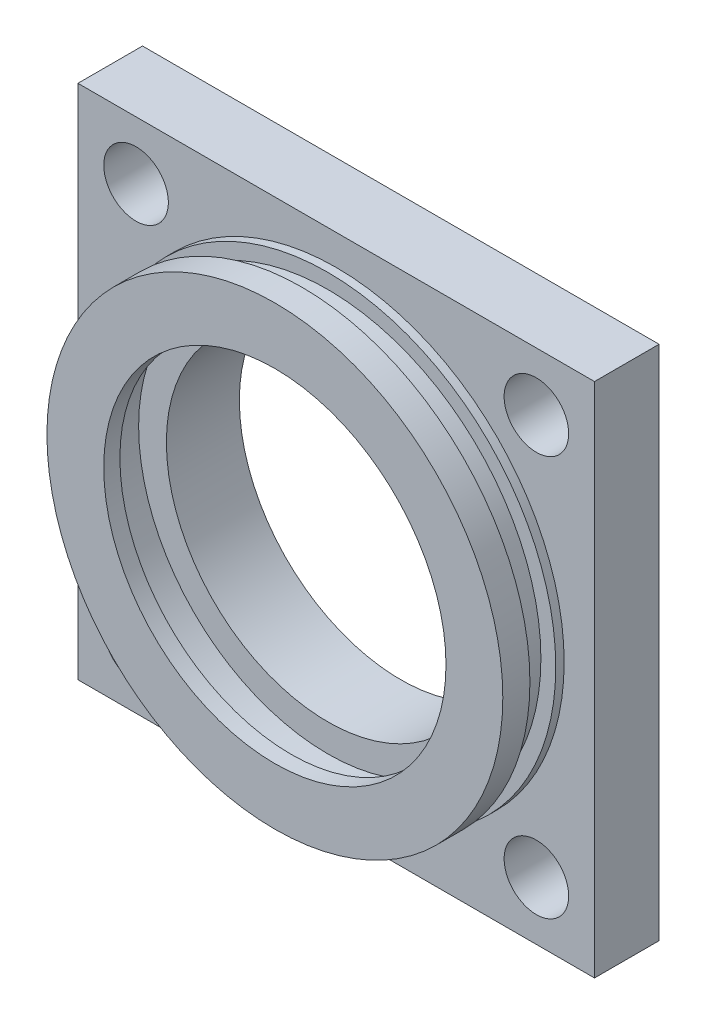
ISO-10303-21;
HEADER;
FILE_DESCRIPTION(('STEP AP214'),'2;1');
FILE_NAME('part.step','',(''),(''),'','','');
FILE_SCHEMA(('AUTOMOTIVE_DESIGN { 1 0 10303 214 1 1 1 1 }'));
ENDSEC;
DATA;
#1=APPLICATION_CONTEXT('core data for automotive mechanical design processes');
#2=APPLICATION_PROTOCOL_DEFINITION('international standard','automotive_design',2000,#1);
#3=PRODUCT_CONTEXT('',#1,'mechanical');
#4=PRODUCT('Part','Part','',(#3));
#5=PRODUCT_RELATED_PRODUCT_CATEGORY('part','',(#4));
#6=PRODUCT_DEFINITION_FORMATION('','',#4);
#7=PRODUCT_DEFINITION_CONTEXT('part definition',#1,'design');
#8=PRODUCT_DEFINITION('design','',#6,#7);
#9=PRODUCT_DEFINITION_SHAPE('','',#8);
#10=(LENGTH_UNIT() NAMED_UNIT(*) SI_UNIT(.MILLI.,.METRE.));
#11=(NAMED_UNIT(*) PLANE_ANGLE_UNIT() SI_UNIT($,.RADIAN.));
#12=(NAMED_UNIT(*) SI_UNIT($,.STERADIAN.) SOLID_ANGLE_UNIT());
#13=UNCERTAINTY_MEASURE_WITH_UNIT(LENGTH_MEASURE(1.E-05),#10,'distance_accuracy_value','');
#14=(GEOMETRIC_REPRESENTATION_CONTEXT(3) GLOBAL_UNCERTAINTY_ASSIGNED_CONTEXT((#13)) GLOBAL_UNIT_ASSIGNED_CONTEXT((#10,
#11,#12)) REPRESENTATION_CONTEXT('',''));
#15=CARTESIAN_POINT('',(0.,0.,0.));
#16=DIRECTION('',(0.,0.,1.));
#17=DIRECTION('',(1.,0.,0.));
#18=AXIS2_PLACEMENT_3D('',#15,#16,#17);
#19=CARTESIAN_POINT('',(0.,40.,16.6));
#20=DIRECTION('',(0.,0.,-1.));
#21=DIRECTION('',(-1.,0.,0.));
#22=AXIS2_PLACEMENT_3D('',#19,#20,#21);
#23=CYLINDRICAL_SURFACE('',#22,29.3);
#24=CARTESIAN_POINT('',(0.,40.,17.));
#25=DIRECTION('',(0.,0.,1.));
#26=DIRECTION('',(1.,0.,0.));
#27=AXIS2_PLACEMENT_3D('',#24,#25,#26);
#28=CIRCLE('',#27,29.3);
#29=CARTESIAN_POINT('',(29.3,40.,17.));
#30=VERTEX_POINT('',#29);
#31=EDGE_CURVE('E174',#30,#30,#28,.T.);
#32=ORIENTED_EDGE('',*,*,#31,.T.);
#33=EDGE_LOOP('',(#32));
#34=FACE_BOUND('',#33,.T.);
#35=CARTESIAN_POINT('',(0.,40.,11.3));
#36=DIRECTION('',(0.,0.,1.));
#37=DIRECTION('',(1.,0.,0.));
#38=AXIS2_PLACEMENT_3D('',#35,#36,#37);
#39=CIRCLE('',#38,29.3);
#40=CARTESIAN_POINT('',(29.3,40.,11.3));
#41=VERTEX_POINT('',#40);
#42=EDGE_CURVE('E139',#41,#41,#39,.T.);
#43=ORIENTED_EDGE('',*,*,#42,.F.);
#44=EDGE_LOOP('',(#43));
#45=FACE_BOUND('',#44,.T.);
#46=ADVANCED_FACE('F39',(#34,#45),#23,.F.);
#47=CARTESIAN_POINT('',(0.,40.,11.3));
#48=DIRECTION('',(0.,0.,1.));
#49=DIRECTION('',(1.,0.,0.));
#50=AXIS2_PLACEMENT_3D('',#47,#48,#49);
#51=PLANE('',#50);
#52=CARTESIAN_POINT('',(0.,40.,11.3));
#53=DIRECTION('',(0.,0.,-1.));
#54=DIRECTION('',(-1.,0.,0.));
#55=AXIS2_PLACEMENT_3D('',#52,#53,#54);
#56=CIRCLE('',#55,25.);
#57=CARTESIAN_POINT('',(-25.,40.,11.3));
#58=VERTEX_POINT('',#57);
#59=EDGE_CURVE('E170',#58,#58,#56,.T.);
#60=ORIENTED_EDGE('',*,*,#59,.T.);
#61=EDGE_LOOP('',(#60));
#62=FACE_BOUND('',#61,.T.);
#63=ORIENTED_EDGE('',*,*,#42,.T.);
#64=EDGE_LOOP('',(#63));
#65=FACE_BOUND('',#64,.T.);
#66=ADVANCED_FACE('F253',(#62,#65),#51,.T.);
#67=CARTESIAN_POINT('',(0.,40.,17.));
#68=DIRECTION('',(0.,0.,1.));
#69=DIRECTION('',(1.,0.,0.));
#70=AXIS2_PLACEMENT_3D('',#67,#68,#69);
#71=PLANE('',#70);
#72=CARTESIAN_POINT('',(0.,40.,17.));
#73=DIRECTION('',(0.,0.,1.));
#74=DIRECTION('',(1.,0.,0.));
#75=AXIS2_PLACEMENT_3D('',#72,#73,#74);
#76=CIRCLE('',#75,26.5);
#77=CARTESIAN_POINT('',(26.5,40.,17.));
#78=VERTEX_POINT('',#77);
#79=EDGE_CURVE('E181',#78,#78,#76,.T.);
#80=ORIENTED_EDGE('',*,*,#79,.T.);
#81=EDGE_LOOP('',(#80));
#82=FACE_BOUND('',#81,.T.);
#83=ORIENTED_EDGE('',*,*,#31,.F.);
#84=EDGE_LOOP('',(#83));
#85=FACE_BOUND('',#84,.T.);
#86=ADVANCED_FACE('F230',(#82,#85),#71,.F.);
#87=CARTESIAN_POINT('',(0.,40.,19.5));
#88=DIRECTION('',(0.,0.,-1.));
#89=DIRECTION('',(-1.,0.,0.));
#90=AXIS2_PLACEMENT_3D('',#87,#88,#89);
#91=CYLINDRICAL_SURFACE('',#90,35.3);
#92=CARTESIAN_POINT('',(0.,40.,10.));
#93=DIRECTION('',(0.,0.,1.));
#94=DIRECTION('',(1.,0.,0.));
#95=AXIS2_PLACEMENT_3D('',#92,#93,#94);
#96=CIRCLE('',#95,35.3);
#97=CARTESIAN_POINT('',(35.3,40.,10.));
#98=VERTEX_POINT('',#97);
#99=EDGE_CURVE('E11',#98,#98,#96,.T.);
#100=ORIENTED_EDGE('',*,*,#99,.T.);
#101=EDGE_LOOP('',(#100));
#102=FACE_BOUND('',#101,.T.);
#103=CARTESIAN_POINT('',(0.,40.,11.3));
#104=DIRECTION('',(0.,0.,1.));
#105=DIRECTION('',(1.,0.,0.));
#106=AXIS2_PLACEMENT_3D('',#103,#104,#105);
#107=CIRCLE('',#106,35.3);
#108=CARTESIAN_POINT('',(35.3,40.,11.3));
#109=VERTEX_POINT('',#108);
#110=EDGE_CURVE('E130',#109,#109,#107,.T.);
#111=ORIENTED_EDGE('',*,*,#110,.F.);
#112=EDGE_LOOP('',(#111));
#113=FACE_BOUND('',#112,.T.);
#114=ADVANCED_FACE('F227',(#102,#113),#91,.T.);
#115=CARTESIAN_POINT('',(-40.,0.,10.));
#116=DIRECTION('',(1.,0.,0.));
#117=DIRECTION('',(0.,1.,0.));
#118=AXIS2_PLACEMENT_3D('',#115,#116,#117);
#119=PLANE('',#118);
#120=DIRECTION('',(0.,-1.,0.));
#121=VECTOR('',#120,1.);
#122=CARTESIAN_POINT('',(-40.,0.,0.));
#123=LINE('',#122,#121);
#124=CARTESIAN_POINT('',(-40.,80.,0.));
#125=VERTEX_POINT('',#124);
#126=CARTESIAN_POINT('',(-40.,0.,0.));
#127=VERTEX_POINT('',#126);
#128=EDGE_CURVE('E113',#125,#127,#123,.T.);
#129=ORIENTED_EDGE('',*,*,#128,.T.);
#130=DIRECTION('',(0.,0.,-1.));
#131=VECTOR('',#130,1.);
#132=CARTESIAN_POINT('',(-40.,0.,10.));
#133=LINE('',#132,#131);
#134=CARTESIAN_POINT('',(-40.,0.,10.));
#135=VERTEX_POINT('',#134);
#136=EDGE_CURVE('E50',#135,#127,#133,.T.);
#137=ORIENTED_EDGE('',*,*,#136,.F.);
#138=DIRECTION('',(0.,-1.,0.));
#139=VECTOR('',#138,1.);
#140=CARTESIAN_POINT('',(-40.,0.,10.));
#141=LINE('',#140,#139);
#142=CARTESIAN_POINT('',(-40.,80.,10.));
#143=VERTEX_POINT('',#142);
#144=EDGE_CURVE('E95',#143,#135,#141,.T.);
#145=ORIENTED_EDGE('',*,*,#144,.F.);
#146=DIRECTION('',(0.,0.,-1.));
#147=VECTOR('',#146,1.);
#148=CARTESIAN_POINT('',(-40.,80.,10.));
#149=LINE('',#148,#147);
#150=EDGE_CURVE('E109',#143,#125,#149,.T.);
#151=ORIENTED_EDGE('',*,*,#150,.T.);
#152=EDGE_LOOP('',(#129,#137,#145,#151));
#153=FACE_BOUND('',#152,.T.);
#154=ADVANCED_FACE('F41',(#153),#119,.F.);
#155=CARTESIAN_POINT('',(40.,0.,10.));
#156=DIRECTION('',(0.,1.,0.));
#157=DIRECTION('',(0.,0.,1.));
#158=AXIS2_PLACEMENT_3D('',#155,#156,#157);
#159=PLANE('',#158);
#160=DIRECTION('',(1.,0.,0.));
#161=VECTOR('',#160,1.);
#162=CARTESIAN_POINT('',(40.,0.,0.));
#163=LINE('',#162,#161);
#164=CARTESIAN_POINT('',(40.,0.,0.));
#165=VERTEX_POINT('',#164);
#166=EDGE_CURVE('E101',#127,#165,#163,.T.);
#167=ORIENTED_EDGE('',*,*,#166,.T.);
#168=DIRECTION('',(0.,0.,-1.));
#169=VECTOR('',#168,1.);
#170=CARTESIAN_POINT('',(40.,0.,10.));
#171=LINE('',#170,#169);
#172=CARTESIAN_POINT('',(40.,0.,10.));
#173=VERTEX_POINT('',#172);
#174=EDGE_CURVE('E99',#173,#165,#171,.T.);
#175=ORIENTED_EDGE('',*,*,#174,.F.);
#176=DIRECTION('',(1.,0.,0.));
#177=VECTOR('',#176,1.);
#178=CARTESIAN_POINT('',(40.,0.,10.));
#179=LINE('',#178,#177);
#180=EDGE_CURVE('E90',#135,#173,#179,.T.);
#181=ORIENTED_EDGE('',*,*,#180,.F.);
#182=ORIENTED_EDGE('',*,*,#136,.T.);
#183=EDGE_LOOP('',(#167,#175,#181,#182));
#184=FACE_BOUND('',#183,.T.);
#185=ADVANCED_FACE('F100',(#184),#159,.F.);
#186=CARTESIAN_POINT('',(40.,80.,10.));
#187=DIRECTION('',(-1.,0.,0.));
#188=DIRECTION('',(0.,-1.,0.));
#189=AXIS2_PLACEMENT_3D('',#186,#187,#188);
#190=PLANE('',#189);
#191=DIRECTION('',(0.,1.,0.));
#192=VECTOR('',#191,1.);
#193=CARTESIAN_POINT('',(40.,80.,0.));
#194=LINE('',#193,#192);
#195=CARTESIAN_POINT('',(40.,80.,0.));
#196=VERTEX_POINT('',#195);
#197=EDGE_CURVE('E76',#165,#196,#194,.T.);
#198=ORIENTED_EDGE('',*,*,#197,.T.);
#199=DIRECTION('',(0.,0.,-1.));
#200=VECTOR('',#199,1.);
#201=CARTESIAN_POINT('',(40.,80.,10.));
#202=LINE('',#201,#200);
#203=CARTESIAN_POINT('',(40.,80.,10.));
#204=VERTEX_POINT('',#203);
#205=EDGE_CURVE('E103',#204,#196,#202,.T.);
#206=ORIENTED_EDGE('',*,*,#205,.F.);
#207=DIRECTION('',(0.,1.,0.));
#208=VECTOR('',#207,1.);
#209=CARTESIAN_POINT('',(40.,80.,10.));
#210=LINE('',#209,#208);
#211=EDGE_CURVE('E93',#173,#204,#210,.T.);
#212=ORIENTED_EDGE('',*,*,#211,.F.);
#213=ORIENTED_EDGE('',*,*,#174,.T.);
#214=EDGE_LOOP('',(#198,#206,#212,#213));
#215=FACE_BOUND('',#214,.T.);
#216=ADVANCED_FACE('F105',(#215),#190,.F.);
#217=CARTESIAN_POINT('',(-40.,80.,10.));
#218=DIRECTION('',(0.,-1.,0.));
#219=DIRECTION('',(1.,0.,0.));
#220=AXIS2_PLACEMENT_3D('',#217,#218,#219);
#221=PLANE('',#220);
#222=DIRECTION('',(-1.,0.,0.));
#223=VECTOR('',#222,1.);
#224=CARTESIAN_POINT('',(-40.,80.,0.));
#225=LINE('',#224,#223);
#226=EDGE_CURVE('E82',#196,#125,#225,.T.);
#227=ORIENTED_EDGE('',*,*,#226,.T.);
#228=ORIENTED_EDGE('',*,*,#150,.F.);
#229=DIRECTION('',(-1.,0.,0.));
#230=VECTOR('',#229,1.);
#231=CARTESIAN_POINT('',(-40.,80.,10.));
#232=LINE('',#231,#230);
#233=EDGE_CURVE('E59',#204,#143,#232,.T.);
#234=ORIENTED_EDGE('',*,*,#233,.F.);
#235=ORIENTED_EDGE('',*,*,#205,.T.);
#236=EDGE_LOOP('',(#227,#228,#234,#235));
#237=FACE_BOUND('',#236,.T.);
#238=ADVANCED_FACE('F217',(#237),#221,.F.);
#239=CARTESIAN_POINT('',(0.,0.,10.));
#240=DIRECTION('',(0.,0.,-1.));
#241=DIRECTION('',(-1.,0.,0.));
#242=AXIS2_PLACEMENT_3D('',#239,#240,#241);
#243=PLANE('',#242);
#244=CARTESIAN_POINT('',(-30.9999999999994,9.00000000000001,10.));
#245=DIRECTION('',(0.,0.,-1.));
#246=DIRECTION('',(-1.,0.,0.));
#247=AXIS2_PLACEMENT_3D('',#244,#245,#246);
#248=CIRCLE('',#247,5.);
#249=CARTESIAN_POINT('',(-35.9999999999994,9.00000000000001,10.));
#250=VERTEX_POINT('',#249);
#251=EDGE_CURVE('E165',#250,#250,#248,.F.);
#252=ORIENTED_EDGE('',*,*,#251,.F.);
#253=EDGE_LOOP('',(#252));
#254=FACE_BOUND('',#253,.T.);
#255=CARTESIAN_POINT('',(31.0000000000006,9.00000000000001,10.));
#256=DIRECTION('',(0.,0.,-1.));
#257=DIRECTION('',(-1.,0.,0.));
#258=AXIS2_PLACEMENT_3D('',#255,#256,#257);
#259=CIRCLE('',#258,5.);
#260=CARTESIAN_POINT('',(26.0000000000006,9.00000000000001,10.));
#261=VERTEX_POINT('',#260);
#262=EDGE_CURVE('E152',#261,#261,#259,.F.);
#263=ORIENTED_EDGE('',*,*,#262,.F.);
#264=EDGE_LOOP('',(#263));
#265=FACE_BOUND('',#264,.T.);
#266=CARTESIAN_POINT('',(31.,71.,10.));
#267=DIRECTION('',(0.,0.,-1.));
#268=DIRECTION('',(-1.,0.,0.));
#269=AXIS2_PLACEMENT_3D('',#266,#267,#268);
#270=CIRCLE('',#269,5.);
#271=CARTESIAN_POINT('',(26.,71.,10.));
#272=VERTEX_POINT('',#271);
#273=EDGE_CURVE('E148',#272,#272,#270,.F.);
#274=ORIENTED_EDGE('',*,*,#273,.F.);
#275=EDGE_LOOP('',(#274));
#276=FACE_BOUND('',#275,.T.);
#277=CARTESIAN_POINT('',(-31.,71.,10.));
#278=DIRECTION('',(0.,0.,-1.));
#279=DIRECTION('',(-1.,0.,0.));
#280=AXIS2_PLACEMENT_3D('',#277,#278,#279);
#281=CIRCLE('',#280,5.);
#282=CARTESIAN_POINT('',(-36.,71.,10.));
#283=VERTEX_POINT('',#282);
#284=EDGE_CURVE('E144',#283,#283,#281,.F.);
#285=ORIENTED_EDGE('',*,*,#284,.F.);
#286=EDGE_LOOP('',(#285));
#287=FACE_BOUND('',#286,.T.);
#288=ORIENTED_EDGE('',*,*,#99,.F.);
#289=EDGE_LOOP('',(#288));
#290=FACE_BOUND('',#289,.T.);
#291=ORIENTED_EDGE('',*,*,#144,.T.);
#292=ORIENTED_EDGE('',*,*,#180,.T.);
#293=ORIENTED_EDGE('',*,*,#211,.T.);
#294=ORIENTED_EDGE('',*,*,#233,.T.);
#295=EDGE_LOOP('',(#291,#292,#293,#294));
#296=FACE_BOUND('',#295,.T.);
#297=ADVANCED_FACE('F91',(#254,#265,#276,#287,#290,#296),#243,.F.);
#298=CARTESIAN_POINT('',(0.,0.,0.));
#299=DIRECTION('',(0.,0.,-1.));
#300=DIRECTION('',(-1.,0.,0.));
#301=AXIS2_PLACEMENT_3D('',#298,#299,#300);
#302=PLANE('',#301);
#303=CARTESIAN_POINT('',(-30.9999999999994,9.00000000000001,0.));
#304=DIRECTION('',(0.,0.,-1.));
#305=DIRECTION('',(-1.,0.,0.));
#306=AXIS2_PLACEMENT_3D('',#303,#304,#305);
#307=CIRCLE('',#306,5.);
#308=CARTESIAN_POINT('',(-35.9999999999994,9.00000000000001,0.));
#309=VERTEX_POINT('',#308);
#310=EDGE_CURVE('E43',#309,#309,#307,.F.);
#311=ORIENTED_EDGE('',*,*,#310,.T.);
#312=EDGE_LOOP('',(#311));
#313=FACE_BOUND('',#312,.T.);
#314=CARTESIAN_POINT('',(31.0000000000006,9.00000000000001,0.));
#315=DIRECTION('',(0.,0.,-1.));
#316=DIRECTION('',(-1.,0.,0.));
#317=AXIS2_PLACEMENT_3D('',#314,#315,#316);
#318=CIRCLE('',#317,5.);
#319=CARTESIAN_POINT('',(26.0000000000006,9.00000000000001,0.));
#320=VERTEX_POINT('',#319);
#321=EDGE_CURVE('E149',#320,#320,#318,.F.);
#322=ORIENTED_EDGE('',*,*,#321,.T.);
#323=EDGE_LOOP('',(#322));
#324=FACE_BOUND('',#323,.T.);
#325=CARTESIAN_POINT('',(31.,71.,0.));
#326=DIRECTION('',(0.,0.,-1.));
#327=DIRECTION('',(-1.,0.,0.));
#328=AXIS2_PLACEMENT_3D('',#325,#326,#327);
#329=CIRCLE('',#328,5.);
#330=CARTESIAN_POINT('',(26.,71.,0.));
#331=VERTEX_POINT('',#330);
#332=EDGE_CURVE('E145',#331,#331,#329,.F.);
#333=ORIENTED_EDGE('',*,*,#332,.T.);
#334=EDGE_LOOP('',(#333));
#335=FACE_BOUND('',#334,.T.);
#336=CARTESIAN_POINT('',(-31.,71.,0.));
#337=DIRECTION('',(0.,0.,-1.));
#338=DIRECTION('',(-1.,0.,0.));
#339=AXIS2_PLACEMENT_3D('',#336,#337,#338);
#340=CIRCLE('',#339,5.);
#341=CARTESIAN_POINT('',(-36.,71.,0.));
#342=VERTEX_POINT('',#341);
#343=EDGE_CURVE('E140',#342,#342,#340,.F.);
#344=ORIENTED_EDGE('',*,*,#343,.T.);
#345=EDGE_LOOP('',(#344));
#346=FACE_BOUND('',#345,.T.);
#347=CARTESIAN_POINT('',(0.,40.,0.));
#348=DIRECTION('',(0.,0.,-1.));
#349=DIRECTION('',(-1.,0.,0.));
#350=AXIS2_PLACEMENT_3D('',#347,#348,#349);
#351=CIRCLE('',#350,25.);
#352=CARTESIAN_POINT('',(-25.,40.,0.));
#353=VERTEX_POINT('',#352);
#354=EDGE_CURVE('E169',#353,#353,#351,.T.);
#355=ORIENTED_EDGE('',*,*,#354,.F.);
#356=EDGE_LOOP('',(#355));
#357=FACE_BOUND('',#356,.T.);
#358=ORIENTED_EDGE('',*,*,#128,.F.);
#359=ORIENTED_EDGE('',*,*,#226,.F.);
#360=ORIENTED_EDGE('',*,*,#197,.F.);
#361=ORIENTED_EDGE('',*,*,#166,.F.);
#362=EDGE_LOOP('',(#358,#359,#360,#361));
#363=FACE_BOUND('',#362,.T.);
#364=ADVANCED_FACE('F206',(#313,#324,#335,#346,#357,#363),#302,.T.);
#365=CARTESIAN_POINT('',(0.,40.,15.3));
#366=DIRECTION('',(0.,0.,1.));
#367=DIRECTION('',(1.,0.,0.));
#368=AXIS2_PLACEMENT_3D('',#365,#366,#367);
#369=PLANE('',#368);
#370=CARTESIAN_POINT('',(0.,40.,15.3));
#371=DIRECTION('',(0.,0.,1.));
#372=DIRECTION('',(1.,0.,0.));
#373=AXIS2_PLACEMENT_3D('',#370,#371,#372);
#374=CIRCLE('',#373,33.);
#375=CARTESIAN_POINT('',(33.,40.,15.3));
#376=VERTEX_POINT('',#375);
#377=EDGE_CURVE('E135',#376,#376,#374,.T.);
#378=ORIENTED_EDGE('',*,*,#377,.T.);
#379=EDGE_LOOP('',(#378));
#380=FACE_BOUND('',#379,.T.);
#381=CARTESIAN_POINT('',(0.,40.,15.3));
#382=DIRECTION('',(0.,0.,1.));
#383=DIRECTION('',(1.,0.,0.));
#384=AXIS2_PLACEMENT_3D('',#381,#382,#383);
#385=CIRCLE('',#384,35.3);
#386=CARTESIAN_POINT('',(35.3,40.,15.3));
#387=VERTEX_POINT('',#386);
#388=EDGE_CURVE('E134',#387,#387,#385,.T.);
#389=ORIENTED_EDGE('',*,*,#388,.F.);
#390=EDGE_LOOP('',(#389));
#391=FACE_BOUND('',#390,.T.);
#392=ADVANCED_FACE('F238',(#380,#391),#369,.F.);
#393=CARTESIAN_POINT('',(0.,40.,11.3));
#394=DIRECTION('',(0.,0.,1.));
#395=DIRECTION('',(1.,0.,0.));
#396=AXIS2_PLACEMENT_3D('',#393,#394,#395);
#397=PLANE('',#396);
#398=CARTESIAN_POINT('',(0.,40.,11.3));
#399=DIRECTION('',(0.,0.,1.));
#400=DIRECTION('',(1.,0.,0.));
#401=AXIS2_PLACEMENT_3D('',#398,#399,#400);
#402=CIRCLE('',#401,33.);
#403=CARTESIAN_POINT('',(33.,40.,11.3));
#404=VERTEX_POINT('',#403);
#405=EDGE_CURVE('E189',#404,#404,#402,.T.);
#406=ORIENTED_EDGE('',*,*,#405,.F.);
#407=EDGE_LOOP('',(#406));
#408=FACE_BOUND('',#407,.T.);
#409=ORIENTED_EDGE('',*,*,#110,.T.);
#410=EDGE_LOOP('',(#409));
#411=FACE_BOUND('',#410,.T.);
#412=ADVANCED_FACE('F235',(#408,#411),#397,.T.);
#413=CARTESIAN_POINT('',(0.,40.,15.3));
#414=DIRECTION('',(0.,0.,-1.));
#415=DIRECTION('',(-1.,0.,0.));
#416=AXIS2_PLACEMENT_3D('',#413,#414,#415);
#417=CYLINDRICAL_SURFACE('',#416,33.);
#418=ORIENTED_EDGE('',*,*,#377,.F.);
#419=EDGE_LOOP('',(#418));
#420=FACE_BOUND('',#419,.T.);
#421=ORIENTED_EDGE('',*,*,#405,.T.);
#422=EDGE_LOOP('',(#421));
#423=FACE_BOUND('',#422,.T.);
#424=ADVANCED_FACE('F237',(#420,#423),#417,.T.);
#425=CARTESIAN_POINT('',(0.,40.,19.5));
#426=DIRECTION('',(0.,0.,1.));
#427=DIRECTION('',(1.,0.,0.));
#428=AXIS2_PLACEMENT_3D('',#425,#426,#427);
#429=PLANE('',#428);
#430=CARTESIAN_POINT('',(0.,40.,19.5));
#431=DIRECTION('',(0.,0.,1.));
#432=DIRECTION('',(1.,0.,0.));
#433=AXIS2_PLACEMENT_3D('',#430,#431,#432);
#434=CIRCLE('',#433,26.5);
#435=CARTESIAN_POINT('',(26.5,40.,19.5));
#436=VERTEX_POINT('',#435);
#437=EDGE_CURVE('E185',#436,#436,#434,.T.);
#438=ORIENTED_EDGE('',*,*,#437,.F.);
#439=EDGE_LOOP('',(#438));
#440=FACE_BOUND('',#439,.T.);
#441=CARTESIAN_POINT('',(0.,40.,19.5));
#442=DIRECTION('',(0.,0.,1.));
#443=DIRECTION('',(1.,0.,0.));
#444=AXIS2_PLACEMENT_3D('',#441,#442,#443);
#445=CIRCLE('',#444,35.3);
#446=CARTESIAN_POINT('',(35.3,40.,19.5));
#447=VERTEX_POINT('',#446);
#448=EDGE_CURVE('E117',#447,#447,#445,.T.);
#449=ORIENTED_EDGE('',*,*,#448,.T.);
#450=EDGE_LOOP('',(#449));
#451=FACE_BOUND('',#450,.T.);
#452=ADVANCED_FACE('F245',(#440,#451),#429,.T.);
#453=ORIENTED_EDGE('',*,*,#388,.T.);
#454=EDGE_LOOP('',(#453));
#455=FACE_BOUND('',#454,.T.);
#456=ORIENTED_EDGE('',*,*,#448,.F.);
#457=EDGE_LOOP('',(#456));
#458=FACE_BOUND('',#457,.T.);
#459=ADVANCED_FACE('F232',(#455,#458),#91,.T.);
#460=CARTESIAN_POINT('',(0.,40.,17.));
#461=DIRECTION('',(0.,0.,1.));
#462=DIRECTION('',(1.,0.,0.));
#463=AXIS2_PLACEMENT_3D('',#460,#461,#462);
#464=CYLINDRICAL_SURFACE('',#463,26.5);
#465=ORIENTED_EDGE('',*,*,#79,.F.);
#466=EDGE_LOOP('',(#465));
#467=FACE_BOUND('',#466,.T.);
#468=ORIENTED_EDGE('',*,*,#437,.T.);
#469=EDGE_LOOP('',(#468));
#470=FACE_BOUND('',#469,.T.);
#471=ADVANCED_FACE('F265',(#467,#470),#464,.F.);
#472=CARTESIAN_POINT('',(0.,40.,11.3));
#473=DIRECTION('',(0.,0.,-1.));
#474=DIRECTION('',(-1.,0.,0.));
#475=AXIS2_PLACEMENT_3D('',#472,#473,#474);
#476=CYLINDRICAL_SURFACE('',#475,25.);
#477=ORIENTED_EDGE('',*,*,#59,.F.);
#478=EDGE_LOOP('',(#477));
#479=FACE_BOUND('',#478,.T.);
#480=ORIENTED_EDGE('',*,*,#354,.T.);
#481=EDGE_LOOP('',(#480));
#482=FACE_BOUND('',#481,.T.);
#483=ADVANCED_FACE('F305',(#479,#482),#476,.F.);
#484=CARTESIAN_POINT('',(-31.,71.,64.));
#485=DIRECTION('',(0.,0.,-1.));
#486=DIRECTION('',(-1.,0.,0.));
#487=AXIS2_PLACEMENT_3D('',#484,#485,#486);
#488=CYLINDRICAL_SURFACE('',#487,5.);
#489=ORIENTED_EDGE('',*,*,#343,.F.);
#490=EDGE_LOOP('',(#489));
#491=FACE_BOUND('',#490,.T.);
#492=ORIENTED_EDGE('',*,*,#284,.T.);
#493=EDGE_LOOP('',(#492));
#494=FACE_BOUND('',#493,.T.);
#495=ADVANCED_FACE('F310',(#491,#494),#488,.F.);
#496=CARTESIAN_POINT('',(31.,71.,64.));
#497=DIRECTION('',(0.,0.,-1.));
#498=DIRECTION('',(-1.,0.,0.));
#499=AXIS2_PLACEMENT_3D('',#496,#497,#498);
#500=CYLINDRICAL_SURFACE('',#499,5.);
#501=ORIENTED_EDGE('',*,*,#332,.F.);
#502=EDGE_LOOP('',(#501));
#503=FACE_BOUND('',#502,.T.);
#504=ORIENTED_EDGE('',*,*,#273,.T.);
#505=EDGE_LOOP('',(#504));
#506=FACE_BOUND('',#505,.T.);
#507=ADVANCED_FACE('F335',(#503,#506),#500,.F.);
#508=CARTESIAN_POINT('',(31.0000000000006,9.00000000000001,64.));
#509=DIRECTION('',(0.,0.,-1.));
#510=DIRECTION('',(-1.,0.,0.));
#511=AXIS2_PLACEMENT_3D('',#508,#509,#510);
#512=CYLINDRICAL_SURFACE('',#511,5.);
#513=ORIENTED_EDGE('',*,*,#321,.F.);
#514=EDGE_LOOP('',(#513));
#515=FACE_BOUND('',#514,.T.);
#516=ORIENTED_EDGE('',*,*,#262,.T.);
#517=EDGE_LOOP('',(#516));
#518=FACE_BOUND('',#517,.T.);
#519=ADVANCED_FACE('F211',(#515,#518),#512,.F.);
#520=CARTESIAN_POINT('',(-30.9999999999994,9.00000000000001,64.));
#521=DIRECTION('',(0.,0.,-1.));
#522=DIRECTION('',(-1.,0.,0.));
#523=AXIS2_PLACEMENT_3D('',#520,#521,#522);
#524=CYLINDRICAL_SURFACE('',#523,5.);
#525=ORIENTED_EDGE('',*,*,#310,.F.);
#526=EDGE_LOOP('',(#525));
#527=FACE_BOUND('',#526,.T.);
#528=ORIENTED_EDGE('',*,*,#251,.T.);
#529=EDGE_LOOP('',(#528));
#530=FACE_BOUND('',#529,.T.);
#531=ADVANCED_FACE('F208',(#527,#530),#524,.F.);
#532=CLOSED_SHELL('',(#46,#66,#86,#114,#154,#185,#216,#238,#297,#364,#392,#412,#424,#452,#459,
#471,#483,#495,#507,#519,#531));
#533=MANIFOLD_SOLID_BREP('B2',#532);
#534=ADVANCED_BREP_SHAPE_REPRESENTATION('',(#18,#533),#14);
#535=SHAPE_DEFINITION_REPRESENTATION(#9,#534);
ENDSEC;
END-ISO-10303-21;
